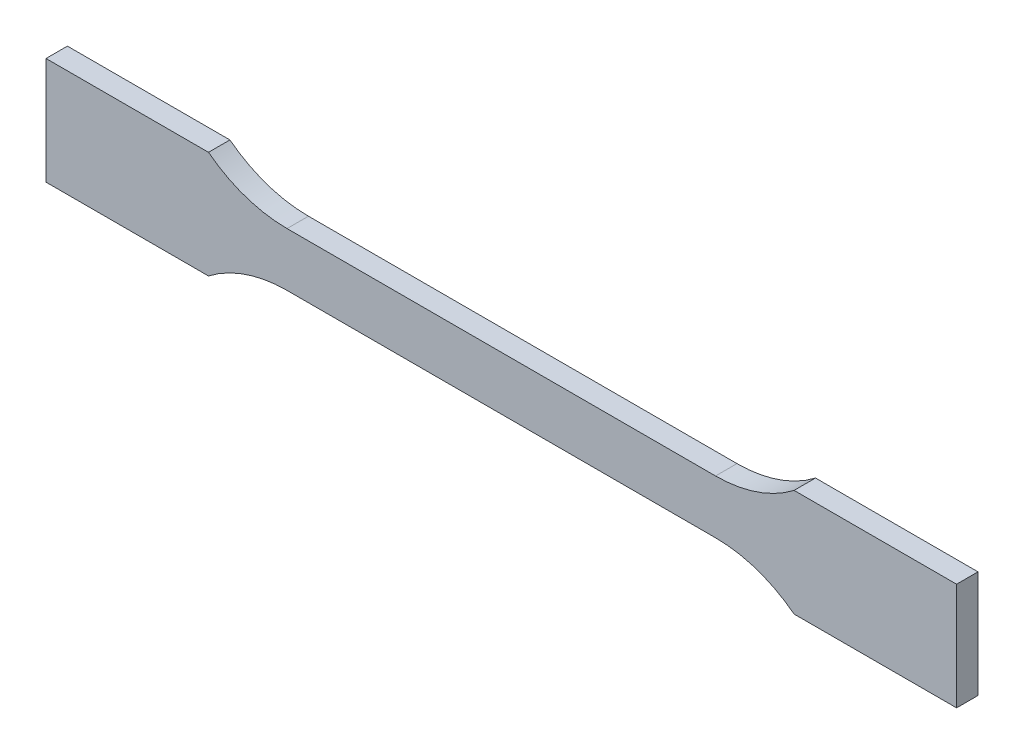
ISO-10303-21;
HEADER;
FILE_DESCRIPTION(('STEP AP214'),'2;1');
FILE_NAME('part.step','',(''),(''),'','','');
FILE_SCHEMA(('AUTOMOTIVE_DESIGN { 1 0 10303 214 1 1 1 1 }'));
ENDSEC;
DATA;
#1=APPLICATION_CONTEXT('core data for automotive mechanical design processes');
#2=APPLICATION_PROTOCOL_DEFINITION('international standard','automotive_design',2000,#1);
#3=PRODUCT_CONTEXT('',#1,'mechanical');
#4=PRODUCT('Part','Part','',(#3));
#5=PRODUCT_RELATED_PRODUCT_CATEGORY('part','',(#4));
#6=PRODUCT_DEFINITION_FORMATION('','',#4);
#7=PRODUCT_DEFINITION_CONTEXT('part definition',#1,'design');
#8=PRODUCT_DEFINITION('design','',#6,#7);
#9=PRODUCT_DEFINITION_SHAPE('','',#8);
#10=(LENGTH_UNIT() NAMED_UNIT(*) SI_UNIT(.MILLI.,.METRE.));
#11=(NAMED_UNIT(*) PLANE_ANGLE_UNIT() SI_UNIT($,.RADIAN.));
#12=(NAMED_UNIT(*) SI_UNIT($,.STERADIAN.) SOLID_ANGLE_UNIT());
#13=UNCERTAINTY_MEASURE_WITH_UNIT(LENGTH_MEASURE(1.E-05),#10,'distance_accuracy_value','');
#14=(GEOMETRIC_REPRESENTATION_CONTEXT(3) GLOBAL_UNCERTAINTY_ASSIGNED_CONTEXT((#13)) GLOBAL_UNIT_ASSIGNED_CONTEXT((#10,
#11,#12)) REPRESENTATION_CONTEXT('',''));
#15=CARTESIAN_POINT('',(0.,0.,0.));
#16=DIRECTION('',(0.,0.,1.));
#17=DIRECTION('',(1.,0.,0.));
#18=AXIS2_PLACEMENT_3D('',#15,#16,#17);
#19=CARTESIAN_POINT('',(-85.,10.,2.));
#20=DIRECTION('',(0.,-1.,0.));
#21=DIRECTION('',(0.,0.,-1.));
#22=AXIS2_PLACEMENT_3D('',#19,#20,#21);
#23=PLANE('',#22);
#24=DIRECTION('',(-1.,0.,0.));
#25=VECTOR('',#24,1.);
#26=CARTESIAN_POINT('',(-85.,10.,-2.));
#27=LINE('',#26,#25);
#28=CARTESIAN_POINT('',(-54.6628782986152,10.,-2.));
#29=VERTEX_POINT('',#28);
#30=CARTESIAN_POINT('',(-85.,10.,-2.));
#31=VERTEX_POINT('',#30);
#32=EDGE_CURVE('E170',#29,#31,#27,.T.);
#33=ORIENTED_EDGE('',*,*,#32,.T.);
#34=DIRECTION('',(0.,0.,-1.));
#35=VECTOR('',#34,1.);
#36=CARTESIAN_POINT('',(-85.,10.,2.));
#37=LINE('',#36,#35);
#38=CARTESIAN_POINT('',(-85.,10.,2.));
#39=VERTEX_POINT('',#38);
#40=EDGE_CURVE('E11',#39,#31,#37,.T.);
#41=ORIENTED_EDGE('',*,*,#40,.F.);
#42=DIRECTION('',(-1.,0.,0.));
#43=VECTOR('',#42,1.);
#44=CARTESIAN_POINT('',(-85.,10.,2.));
#45=LINE('',#44,#43);
#46=CARTESIAN_POINT('',(-54.6628782986152,10.,2.));
#47=VERTEX_POINT('',#46);
#48=EDGE_CURVE('E204',#47,#39,#45,.T.);
#49=ORIENTED_EDGE('',*,*,#48,.F.);
#50=DIRECTION('',(0.,0.,-1.));
#51=VECTOR('',#50,1.);
#52=CARTESIAN_POINT('',(-54.6628782986152,10.,2.));
#53=LINE('',#52,#51);
#54=EDGE_CURVE('E166',#47,#29,#53,.T.);
#55=ORIENTED_EDGE('',*,*,#54,.T.);
#56=EDGE_LOOP('',(#33,#41,#49,#55));
#57=FACE_BOUND('',#56,.T.);
#58=ADVANCED_FACE('F45',(#57),#23,.F.);
#59=CARTESIAN_POINT('',(-85.,10.,2.));
#60=DIRECTION('',(1.,0.,0.));
#61=DIRECTION('',(0.,0.,-1.));
#62=AXIS2_PLACEMENT_3D('',#59,#60,#61);
#63=PLANE('',#62);
#64=DIRECTION('',(0.,-1.,0.));
#65=VECTOR('',#64,1.);
#66=CARTESIAN_POINT('',(-85.,10.,-2.));
#67=LINE('',#66,#65);
#68=CARTESIAN_POINT('',(-85.,-10.,-2.));
#69=VERTEX_POINT('',#68);
#70=EDGE_CURVE('E174',#31,#69,#67,.T.);
#71=ORIENTED_EDGE('',*,*,#70,.T.);
#72=DIRECTION('',(0.,0.,-1.));
#73=VECTOR('',#72,1.);
#74=CARTESIAN_POINT('',(-85.,-10.,2.));
#75=LINE('',#74,#73);
#76=CARTESIAN_POINT('',(-85.,-10.,2.));
#77=VERTEX_POINT('',#76);
#78=EDGE_CURVE('E54',#77,#69,#75,.T.);
#79=ORIENTED_EDGE('',*,*,#78,.F.);
#80=DIRECTION('',(0.,-1.,0.));
#81=VECTOR('',#80,1.);
#82=CARTESIAN_POINT('',(-85.,10.,2.));
#83=LINE('',#82,#81);
#84=EDGE_CURVE('E117',#39,#77,#83,.T.);
#85=ORIENTED_EDGE('',*,*,#84,.F.);
#86=ORIENTED_EDGE('',*,*,#40,.T.);
#87=EDGE_LOOP('',(#71,#79,#85,#86));
#88=FACE_BOUND('',#87,.T.);
#89=ADVANCED_FACE('F298',(#88),#63,.F.);
#90=CARTESIAN_POINT('',(-85.,-10.,2.));
#91=DIRECTION('',(0.,1.,0.));
#92=DIRECTION('',(0.,0.,1.));
#93=AXIS2_PLACEMENT_3D('',#90,#91,#92);
#94=PLANE('',#93);
#95=DIRECTION('',(1.,0.,0.));
#96=VECTOR('',#95,1.);
#97=CARTESIAN_POINT('',(-85.,-10.,-2.));
#98=LINE('',#97,#96);
#99=CARTESIAN_POINT('',(-54.6628782986152,-10.,-2.));
#100=VERTEX_POINT('',#99);
#101=EDGE_CURVE('E177',#69,#100,#98,.T.);
#102=ORIENTED_EDGE('',*,*,#101,.T.);
#103=DIRECTION('',(0.,0.,-1.));
#104=VECTOR('',#103,1.);
#105=CARTESIAN_POINT('',(-54.6628782986152,-10.,2.));
#106=LINE('',#105,#104);
#107=CARTESIAN_POINT('',(-54.6628782986152,-10.,2.));
#108=VERTEX_POINT('',#107);
#109=EDGE_CURVE('E231',#108,#100,#106,.T.);
#110=ORIENTED_EDGE('',*,*,#109,.F.);
#111=DIRECTION('',(1.,0.,0.));
#112=VECTOR('',#111,1.);
#113=CARTESIAN_POINT('',(-85.,-10.,2.));
#114=LINE('',#113,#112);
#115=EDGE_CURVE('E241',#77,#108,#114,.T.);
#116=ORIENTED_EDGE('',*,*,#115,.F.);
#117=ORIENTED_EDGE('',*,*,#78,.T.);
#118=EDGE_LOOP('',(#102,#110,#116,#117));
#119=FACE_BOUND('',#118,.T.);
#120=ADVANCED_FACE('F239',(#119),#94,.F.);
#121=CARTESIAN_POINT('',(-40.,-29.,2.));
#122=DIRECTION('',(0.,0.,-1.));
#123=DIRECTION('',(-1.,0.,0.));
#124=AXIS2_PLACEMENT_3D('',#121,#122,#123);
#125=CYLINDRICAL_SURFACE('',#124,24.);
#126=CARTESIAN_POINT('',(-40.,-29.,-2.));
#127=DIRECTION('',(0.,0.,-1.));
#128=DIRECTION('',(1.,0.,0.));
#129=AXIS2_PLACEMENT_3D('',#126,#127,#128);
#130=CIRCLE('',#129,24.);
#131=CARTESIAN_POINT('',(-40.,-5.,-2.));
#132=VERTEX_POINT('',#131);
#133=EDGE_CURVE('E180',#100,#132,#130,.T.);
#134=ORIENTED_EDGE('',*,*,#133,.T.);
#135=DIRECTION('',(0.,0.,-1.));
#136=VECTOR('',#135,1.);
#137=CARTESIAN_POINT('',(-40.,-5.,2.));
#138=LINE('',#137,#136);
#139=CARTESIAN_POINT('',(-40.,-5.,2.));
#140=VERTEX_POINT('',#139);
#141=EDGE_CURVE('E227',#140,#132,#138,.T.);
#142=ORIENTED_EDGE('',*,*,#141,.F.);
#143=CARTESIAN_POINT('',(-40.,-29.,2.));
#144=DIRECTION('',(0.,0.,-1.));
#145=DIRECTION('',(1.,0.,0.));
#146=AXIS2_PLACEMENT_3D('',#143,#144,#145);
#147=CIRCLE('',#146,24.);
#148=EDGE_CURVE('E260',#108,#140,#147,.T.);
#149=ORIENTED_EDGE('',*,*,#148,.F.);
#150=ORIENTED_EDGE('',*,*,#109,.T.);
#151=EDGE_LOOP('',(#134,#142,#149,#150));
#152=FACE_BOUND('',#151,.T.);
#153=ADVANCED_FACE('F250',(#152),#125,.F.);
#154=CARTESIAN_POINT('',(-40.,-5.,2.));
#155=DIRECTION('',(0.,1.,0.));
#156=DIRECTION('',(0.,0.,1.));
#157=AXIS2_PLACEMENT_3D('',#154,#155,#156);
#158=PLANE('',#157);
#159=DIRECTION('',(1.,0.,0.));
#160=VECTOR('',#159,1.);
#161=CARTESIAN_POINT('',(-40.,-5.,-2.));
#162=LINE('',#161,#160);
#163=CARTESIAN_POINT('',(40.,-5.,-2.));
#164=VERTEX_POINT('',#163);
#165=EDGE_CURVE('E183',#132,#164,#162,.T.);
#166=ORIENTED_EDGE('',*,*,#165,.T.);
#167=DIRECTION('',(0.,0.,-1.));
#168=VECTOR('',#167,1.);
#169=CARTESIAN_POINT('',(40.,-5.,2.));
#170=LINE('',#169,#168);
#171=CARTESIAN_POINT('',(40.,-5.,2.));
#172=VERTEX_POINT('',#171);
#173=EDGE_CURVE('E223',#172,#164,#170,.T.);
#174=ORIENTED_EDGE('',*,*,#173,.F.);
#175=DIRECTION('',(1.,0.,0.));
#176=VECTOR('',#175,1.);
#177=CARTESIAN_POINT('',(-40.,-5.,2.));
#178=LINE('',#177,#176);
#179=EDGE_CURVE('E256',#140,#172,#178,.T.);
#180=ORIENTED_EDGE('',*,*,#179,.F.);
#181=ORIENTED_EDGE('',*,*,#141,.T.);
#182=EDGE_LOOP('',(#166,#174,#180,#181));
#183=FACE_BOUND('',#182,.T.);
#184=ADVANCED_FACE('F254',(#183),#158,.F.);
#185=CARTESIAN_POINT('',(40.,-29.,2.));
#186=DIRECTION('',(0.,0.,-1.));
#187=DIRECTION('',(-1.,0.,0.));
#188=AXIS2_PLACEMENT_3D('',#185,#186,#187);
#189=CYLINDRICAL_SURFACE('',#188,24.);
#190=CARTESIAN_POINT('',(40.,-29.,-2.));
#191=DIRECTION('',(0.,0.,-1.));
#192=DIRECTION('',(-1.,0.,0.));
#193=AXIS2_PLACEMENT_3D('',#190,#191,#192);
#194=CIRCLE('',#193,24.);
#195=CARTESIAN_POINT('',(54.6628782986152,-10.,-2.));
#196=VERTEX_POINT('',#195);
#197=EDGE_CURVE('E186',#164,#196,#194,.T.);
#198=ORIENTED_EDGE('',*,*,#197,.T.);
#199=DIRECTION('',(0.,0.,-1.));
#200=VECTOR('',#199,1.);
#201=CARTESIAN_POINT('',(54.6628782986152,-10.,2.));
#202=LINE('',#201,#200);
#203=CARTESIAN_POINT('',(54.6628782986152,-10.,2.));
#204=VERTEX_POINT('',#203);
#205=EDGE_CURVE('E219',#204,#196,#202,.T.);
#206=ORIENTED_EDGE('',*,*,#205,.F.);
#207=CARTESIAN_POINT('',(40.,-29.,2.));
#208=DIRECTION('',(0.,0.,-1.));
#209=DIRECTION('',(-1.,0.,0.));
#210=AXIS2_PLACEMENT_3D('',#207,#208,#209);
#211=CIRCLE('',#210,24.);
#212=EDGE_CURVE('E259',#172,#204,#211,.T.);
#213=ORIENTED_EDGE('',*,*,#212,.F.);
#214=ORIENTED_EDGE('',*,*,#173,.T.);
#215=EDGE_LOOP('',(#198,#206,#213,#214));
#216=FACE_BOUND('',#215,.T.);
#217=ADVANCED_FACE('F311',(#216),#189,.F.);
#218=CARTESIAN_POINT('',(85.,-10.,2.));
#219=DIRECTION('',(0.,1.,0.));
#220=DIRECTION('',(0.,0.,1.));
#221=AXIS2_PLACEMENT_3D('',#218,#219,#220);
#222=PLANE('',#221);
#223=DIRECTION('',(1.,0.,0.));
#224=VECTOR('',#223,1.);
#225=CARTESIAN_POINT('',(85.,-10.,-2.));
#226=LINE('',#225,#224);
#227=CARTESIAN_POINT('',(85.,-10.,-2.));
#228=VERTEX_POINT('',#227);
#229=EDGE_CURVE('E189',#196,#228,#226,.T.);
#230=ORIENTED_EDGE('',*,*,#229,.T.);
#231=DIRECTION('',(0.,0.,-1.));
#232=VECTOR('',#231,1.);
#233=CARTESIAN_POINT('',(85.,-10.,2.));
#234=LINE('',#233,#232);
#235=CARTESIAN_POINT('',(85.,-10.,2.));
#236=VERTEX_POINT('',#235);
#237=EDGE_CURVE('E215',#236,#228,#234,.T.);
#238=ORIENTED_EDGE('',*,*,#237,.F.);
#239=DIRECTION('',(1.,0.,0.));
#240=VECTOR('',#239,1.);
#241=CARTESIAN_POINT('',(85.,-10.,2.));
#242=LINE('',#241,#240);
#243=EDGE_CURVE('E264',#204,#236,#242,.T.);
#244=ORIENTED_EDGE('',*,*,#243,.F.);
#245=ORIENTED_EDGE('',*,*,#205,.T.);
#246=EDGE_LOOP('',(#230,#238,#244,#245));
#247=FACE_BOUND('',#246,.T.);
#248=ADVANCED_FACE('F314',(#247),#222,.F.);
#249=CARTESIAN_POINT('',(85.,10.,2.));
#250=DIRECTION('',(-1.,0.,0.));
#251=DIRECTION('',(0.,0.,1.));
#252=AXIS2_PLACEMENT_3D('',#249,#250,#251);
#253=PLANE('',#252);
#254=DIRECTION('',(0.,1.,0.));
#255=VECTOR('',#254,1.);
#256=CARTESIAN_POINT('',(85.,10.,-2.));
#257=LINE('',#256,#255);
#258=CARTESIAN_POINT('',(85.,10.,-2.));
#259=VERTEX_POINT('',#258);
#260=EDGE_CURVE('E192',#228,#259,#257,.T.);
#261=ORIENTED_EDGE('',*,*,#260,.T.);
#262=DIRECTION('',(0.,0.,-1.));
#263=VECTOR('',#262,1.);
#264=CARTESIAN_POINT('',(85.,10.,2.));
#265=LINE('',#264,#263);
#266=CARTESIAN_POINT('',(85.,10.,2.));
#267=VERTEX_POINT('',#266);
#268=EDGE_CURVE('E211',#267,#259,#265,.T.);
#269=ORIENTED_EDGE('',*,*,#268,.F.);
#270=DIRECTION('',(0.,1.,0.));
#271=VECTOR('',#270,1.);
#272=CARTESIAN_POINT('',(85.,10.,2.));
#273=LINE('',#272,#271);
#274=EDGE_CURVE('E271',#236,#267,#273,.T.);
#275=ORIENTED_EDGE('',*,*,#274,.F.);
#276=ORIENTED_EDGE('',*,*,#237,.T.);
#277=EDGE_LOOP('',(#261,#269,#275,#276));
#278=FACE_BOUND('',#277,.T.);
#279=ADVANCED_FACE('F279',(#278),#253,.F.);
#280=CARTESIAN_POINT('',(54.6628782986152,10.,2.));
#281=DIRECTION('',(0.,-1.,0.));
#282=DIRECTION('',(0.,0.,-1.));
#283=AXIS2_PLACEMENT_3D('',#280,#281,#282);
#284=PLANE('',#283);
#285=DIRECTION('',(-1.,0.,0.));
#286=VECTOR('',#285,1.);
#287=CARTESIAN_POINT('',(54.6628782986152,10.,-2.));
#288=LINE('',#287,#286);
#289=CARTESIAN_POINT('',(54.6628782986152,10.,-2.));
#290=VERTEX_POINT('',#289);
#291=EDGE_CURVE('E195',#259,#290,#288,.T.);
#292=ORIENTED_EDGE('',*,*,#291,.T.);
#293=DIRECTION('',(0.,0.,-1.));
#294=VECTOR('',#293,1.);
#295=CARTESIAN_POINT('',(54.6628782986152,10.,2.));
#296=LINE('',#295,#294);
#297=CARTESIAN_POINT('',(54.6628782986152,10.,2.));
#298=VERTEX_POINT('',#297);
#299=EDGE_CURVE('E159',#298,#290,#296,.T.);
#300=ORIENTED_EDGE('',*,*,#299,.F.);
#301=DIRECTION('',(-1.,0.,0.));
#302=VECTOR('',#301,1.);
#303=CARTESIAN_POINT('',(54.6628782986152,10.,2.));
#304=LINE('',#303,#302);
#305=EDGE_CURVE('E148',#267,#298,#304,.T.);
#306=ORIENTED_EDGE('',*,*,#305,.F.);
#307=ORIENTED_EDGE('',*,*,#268,.T.);
#308=EDGE_LOOP('',(#292,#300,#306,#307));
#309=FACE_BOUND('',#308,.T.);
#310=ADVANCED_FACE('F283',(#309),#284,.F.);
#311=CARTESIAN_POINT('',(40.,29.,2.));
#312=DIRECTION('',(0.,0.,-1.));
#313=DIRECTION('',(-1.,0.,0.));
#314=AXIS2_PLACEMENT_3D('',#311,#312,#313);
#315=CYLINDRICAL_SURFACE('',#314,24.);
#316=CARTESIAN_POINT('',(40.,29.,-2.));
#317=DIRECTION('',(0.,0.,-1.));
#318=DIRECTION('',(1.,0.,0.));
#319=AXIS2_PLACEMENT_3D('',#316,#317,#318);
#320=CIRCLE('',#319,24.);
#321=CARTESIAN_POINT('',(40.,5.,-2.));
#322=VERTEX_POINT('',#321);
#323=EDGE_CURVE('E157',#290,#322,#320,.T.);
#324=ORIENTED_EDGE('',*,*,#323,.T.);
#325=DIRECTION('',(0.,0.,-1.));
#326=VECTOR('',#325,1.);
#327=CARTESIAN_POINT('',(40.,5.,2.));
#328=LINE('',#327,#326);
#329=CARTESIAN_POINT('',(40.,5.,2.));
#330=VERTEX_POINT('',#329);
#331=EDGE_CURVE('E154',#330,#322,#328,.T.);
#332=ORIENTED_EDGE('',*,*,#331,.F.);
#333=CARTESIAN_POINT('',(40.,29.,2.));
#334=DIRECTION('',(0.,0.,-1.));
#335=DIRECTION('',(1.,0.,0.));
#336=AXIS2_PLACEMENT_3D('',#333,#334,#335);
#337=CIRCLE('',#336,24.);
#338=EDGE_CURVE('E142',#298,#330,#337,.T.);
#339=ORIENTED_EDGE('',*,*,#338,.F.);
#340=ORIENTED_EDGE('',*,*,#299,.T.);
#341=EDGE_LOOP('',(#324,#332,#339,#340));
#342=FACE_BOUND('',#341,.T.);
#343=ADVANCED_FACE('F155',(#342),#315,.F.);
#344=CARTESIAN_POINT('',(-40.,5.,2.));
#345=DIRECTION('',(0.,-1.,0.));
#346=DIRECTION('',(0.,0.,-1.));
#347=AXIS2_PLACEMENT_3D('',#344,#345,#346);
#348=PLANE('',#347);
#349=DIRECTION('',(-1.,0.,0.));
#350=VECTOR('',#349,1.);
#351=CARTESIAN_POINT('',(-40.,5.,-2.));
#352=LINE('',#351,#350);
#353=CARTESIAN_POINT('',(-40.,5.,-2.));
#354=VERTEX_POINT('',#353);
#355=EDGE_CURVE('E103',#322,#354,#352,.T.);
#356=ORIENTED_EDGE('',*,*,#355,.T.);
#357=DIRECTION('',(0.,0.,-1.));
#358=VECTOR('',#357,1.);
#359=CARTESIAN_POINT('',(-40.,5.,2.));
#360=LINE('',#359,#358);
#361=CARTESIAN_POINT('',(-40.,5.,2.));
#362=VERTEX_POINT('',#361);
#363=EDGE_CURVE('E160',#362,#354,#360,.T.);
#364=ORIENTED_EDGE('',*,*,#363,.F.);
#365=DIRECTION('',(-1.,0.,0.));
#366=VECTOR('',#365,1.);
#367=CARTESIAN_POINT('',(-40.,5.,2.));
#368=LINE('',#367,#366);
#369=EDGE_CURVE('E146',#330,#362,#368,.T.);
#370=ORIENTED_EDGE('',*,*,#369,.F.);
#371=ORIENTED_EDGE('',*,*,#331,.T.);
#372=EDGE_LOOP('',(#356,#364,#370,#371));
#373=FACE_BOUND('',#372,.T.);
#374=ADVANCED_FACE('F162',(#373),#348,.F.);
#375=CARTESIAN_POINT('',(-40.,29.,2.));
#376=DIRECTION('',(0.,0.,-1.));
#377=DIRECTION('',(-1.,0.,0.));
#378=AXIS2_PLACEMENT_3D('',#375,#376,#377);
#379=CYLINDRICAL_SURFACE('',#378,24.);
#380=CARTESIAN_POINT('',(-40.,29.,-2.));
#381=DIRECTION('',(0.,0.,-1.));
#382=DIRECTION('',(-1.,0.,0.));
#383=AXIS2_PLACEMENT_3D('',#380,#381,#382);
#384=CIRCLE('',#383,24.);
#385=EDGE_CURVE('E109',#354,#29,#384,.T.);
#386=ORIENTED_EDGE('',*,*,#385,.T.);
#387=ORIENTED_EDGE('',*,*,#54,.F.);
#388=CARTESIAN_POINT('',(-40.,29.,2.));
#389=DIRECTION('',(0.,0.,-1.));
#390=DIRECTION('',(-1.,0.,0.));
#391=AXIS2_PLACEMENT_3D('',#388,#389,#390);
#392=CIRCLE('',#391,24.);
#393=EDGE_CURVE('E62',#362,#47,#392,.T.);
#394=ORIENTED_EDGE('',*,*,#393,.F.);
#395=ORIENTED_EDGE('',*,*,#363,.T.);
#396=EDGE_LOOP('',(#386,#387,#394,#395));
#397=FACE_BOUND('',#396,.T.);
#398=ADVANCED_FACE('F287',(#397),#379,.F.);
#399=CARTESIAN_POINT('',(-40.,29.,2.));
#400=DIRECTION('',(0.,0.,-1.));
#401=DIRECTION('',(-1.,0.,0.));
#402=AXIS2_PLACEMENT_3D('',#399,#400,#401);
#403=PLANE('',#402);
#404=ORIENTED_EDGE('',*,*,#48,.T.);
#405=ORIENTED_EDGE('',*,*,#84,.T.);
#406=ORIENTED_EDGE('',*,*,#115,.T.);
#407=ORIENTED_EDGE('',*,*,#148,.T.);
#408=ORIENTED_EDGE('',*,*,#179,.T.);
#409=ORIENTED_EDGE('',*,*,#212,.T.);
#410=ORIENTED_EDGE('',*,*,#243,.T.);
#411=ORIENTED_EDGE('',*,*,#274,.T.);
#412=ORIENTED_EDGE('',*,*,#305,.T.);
#413=ORIENTED_EDGE('',*,*,#338,.T.);
#414=ORIENTED_EDGE('',*,*,#369,.T.);
#415=ORIENTED_EDGE('',*,*,#393,.T.);
#416=EDGE_LOOP('',(#404,#405,#406,#407,#408,#409,#410,#411,#412,#413,#414,#415));
#417=FACE_BOUND('',#416,.T.);
#418=ADVANCED_FACE('F144',(#417),#403,.F.);
#419=CARTESIAN_POINT('',(-40.,29.,-2.));
#420=DIRECTION('',(0.,0.,-1.));
#421=DIRECTION('',(-1.,0.,0.));
#422=AXIS2_PLACEMENT_3D('',#419,#420,#421);
#423=PLANE('',#422);
#424=ORIENTED_EDGE('',*,*,#32,.F.);
#425=ORIENTED_EDGE('',*,*,#385,.F.);
#426=ORIENTED_EDGE('',*,*,#355,.F.);
#427=ORIENTED_EDGE('',*,*,#323,.F.);
#428=ORIENTED_EDGE('',*,*,#291,.F.);
#429=ORIENTED_EDGE('',*,*,#260,.F.);
#430=ORIENTED_EDGE('',*,*,#229,.F.);
#431=ORIENTED_EDGE('',*,*,#197,.F.);
#432=ORIENTED_EDGE('',*,*,#165,.F.);
#433=ORIENTED_EDGE('',*,*,#133,.F.);
#434=ORIENTED_EDGE('',*,*,#101,.F.);
#435=ORIENTED_EDGE('',*,*,#70,.F.);
#436=EDGE_LOOP('',(#424,#425,#426,#427,#428,#429,#430,#431,#432,#433,#434,#435));
#437=FACE_BOUND('',#436,.T.);
#438=ADVANCED_FACE('F245',(#437),#423,.T.);
#439=CLOSED_SHELL('',(#58,#89,#120,#153,#184,#217,#248,#279,#310,#343,#374,#398,#418,#438));
#440=MANIFOLD_SOLID_BREP('B2',#439);
#441=ADVANCED_BREP_SHAPE_REPRESENTATION('',(#18,#440),#14);
#442=SHAPE_DEFINITION_REPRESENTATION(#9,#441);
ENDSEC;
END-ISO-10303-21;
